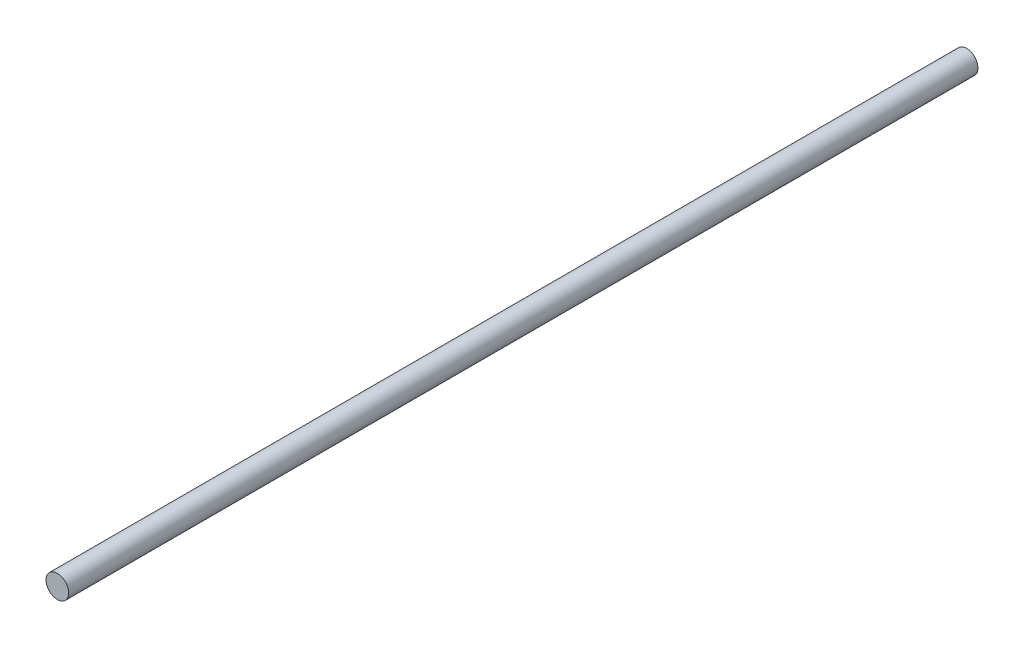
ISO-10303-21;
HEADER;
FILE_DESCRIPTION(('STEP AP214'),'2;1');
FILE_NAME('part.step','',(''),(''),'','','');
FILE_SCHEMA(('AUTOMOTIVE_DESIGN { 1 0 10303 214 1 1 1 1 }'));
ENDSEC;
DATA;
#1=APPLICATION_CONTEXT('core data for automotive mechanical design processes');
#2=APPLICATION_PROTOCOL_DEFINITION('international standard','automotive_design',2000,#1);
#3=PRODUCT_CONTEXT('',#1,'mechanical');
#4=PRODUCT('Part','Part','',(#3));
#5=PRODUCT_RELATED_PRODUCT_CATEGORY('part','',(#4));
#6=PRODUCT_DEFINITION_FORMATION('','',#4);
#7=PRODUCT_DEFINITION_CONTEXT('part definition',#1,'design');
#8=PRODUCT_DEFINITION('design','',#6,#7);
#9=PRODUCT_DEFINITION_SHAPE('','',#8);
#10=(LENGTH_UNIT() NAMED_UNIT(*) SI_UNIT(.MILLI.,.METRE.));
#11=(NAMED_UNIT(*) PLANE_ANGLE_UNIT() SI_UNIT($,.RADIAN.));
#12=(NAMED_UNIT(*) SI_UNIT($,.STERADIAN.) SOLID_ANGLE_UNIT());
#13=UNCERTAINTY_MEASURE_WITH_UNIT(LENGTH_MEASURE(1.E-05),#10,'distance_accuracy_value','');
#14=(GEOMETRIC_REPRESENTATION_CONTEXT(3) GLOBAL_UNCERTAINTY_ASSIGNED_CONTEXT((#13)) GLOBAL_UNIT_ASSIGNED_CONTEXT((#10,
#11,#12)) REPRESENTATION_CONTEXT('',''));
#15=CARTESIAN_POINT('',(0.,0.,0.));
#16=DIRECTION('',(0.,0.,1.));
#17=DIRECTION('',(1.,0.,0.));
#18=AXIS2_PLACEMENT_3D('',#15,#16,#17);
#19=CARTESIAN_POINT('',(0.,0.,80.));
#20=DIRECTION('',(0.,0.,-1.));
#21=DIRECTION('',(-1.,0.,0.));
#22=AXIS2_PLACEMENT_3D('',#19,#20,#21);
#23=CYLINDRICAL_SURFACE('',#22,1.);
#24=CARTESIAN_POINT('',(0.,0.,80.));
#25=DIRECTION('',(0.,0.,1.));
#26=DIRECTION('',(1.,0.,0.));
#27=AXIS2_PLACEMENT_3D('',#24,#25,#26);
#28=CIRCLE('',#27,1.);
#29=CARTESIAN_POINT('',(1.,0.,80.));
#30=VERTEX_POINT('',#29);
#31=EDGE_CURVE('E10',#30,#30,#28,.T.);
#32=ORIENTED_EDGE('',*,*,#31,.F.);
#33=EDGE_LOOP('',(#32));
#34=FACE_BOUND('',#33,.T.);
#35=CARTESIAN_POINT('',(0.,0.,0.));
#36=DIRECTION('',(0.,0.,1.));
#37=DIRECTION('',(1.,0.,0.));
#38=AXIS2_PLACEMENT_3D('',#35,#36,#37);
#39=CIRCLE('',#38,1.);
#40=CARTESIAN_POINT('',(1.,0.,0.));
#41=VERTEX_POINT('',#40);
#42=EDGE_CURVE('E36',#41,#41,#39,.T.);
#43=ORIENTED_EDGE('',*,*,#42,.T.);
#44=EDGE_LOOP('',(#43));
#45=FACE_BOUND('',#44,.T.);
#46=ADVANCED_FACE('F33',(#34,#45),#23,.T.);
#47=CARTESIAN_POINT('',(0.,0.,80.));
#48=DIRECTION('',(0.,0.,1.));
#49=DIRECTION('',(1.,0.,0.));
#50=AXIS2_PLACEMENT_3D('',#47,#48,#49);
#51=PLANE('',#50);
#52=ORIENTED_EDGE('',*,*,#31,.T.);
#53=EDGE_LOOP('',(#52));
#54=FACE_BOUND('',#53,.T.);
#55=ADVANCED_FACE('F48',(#54),#51,.T.);
#56=CARTESIAN_POINT('',(0.,0.,0.));
#57=DIRECTION('',(0.,0.,1.));
#58=DIRECTION('',(1.,0.,0.));
#59=AXIS2_PLACEMENT_3D('',#56,#57,#58);
#60=PLANE('',#59);
#61=ORIENTED_EDGE('',*,*,#42,.F.);
#62=EDGE_LOOP('',(#61));
#63=FACE_BOUND('',#62,.T.);
#64=ADVANCED_FACE('F46',(#63),#60,.F.);
#65=CLOSED_SHELL('',(#46,#55,#64));
#66=MANIFOLD_SOLID_BREP('B2',#65);
#67=ADVANCED_BREP_SHAPE_REPRESENTATION('',(#18,#66),#14);
#68=SHAPE_DEFINITION_REPRESENTATION(#9,#67);
ENDSEC;
END-ISO-10303-21;
